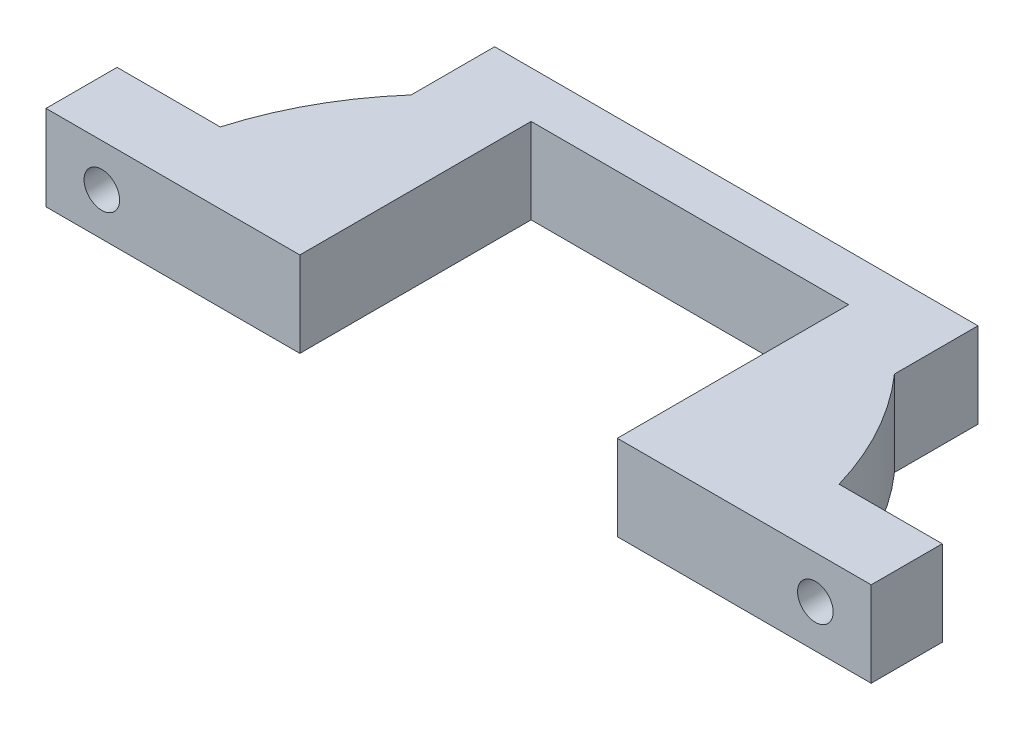
ISO-10303-21;
HEADER;
FILE_DESCRIPTION(('STEP AP214'),'2;1');
FILE_NAME('part.step','',(''),(''),'','','');
FILE_SCHEMA(('AUTOMOTIVE_DESIGN { 1 0 10303 214 1 1 1 1 }'));
ENDSEC;
DATA;
#1=APPLICATION_CONTEXT('core data for automotive mechanical design processes');
#2=APPLICATION_PROTOCOL_DEFINITION('international standard','automotive_design',2000,#1);
#3=PRODUCT_CONTEXT('',#1,'mechanical');
#4=PRODUCT('Part','Part','',(#3));
#5=PRODUCT_RELATED_PRODUCT_CATEGORY('part','',(#4));
#6=PRODUCT_DEFINITION_FORMATION('','',#4);
#7=PRODUCT_DEFINITION_CONTEXT('part definition',#1,'design');
#8=PRODUCT_DEFINITION('design','',#6,#7);
#9=PRODUCT_DEFINITION_SHAPE('','',#8);
#10=(LENGTH_UNIT() NAMED_UNIT(*) SI_UNIT(.MILLI.,.METRE.));
#11=(NAMED_UNIT(*) PLANE_ANGLE_UNIT() SI_UNIT($,.RADIAN.));
#12=(NAMED_UNIT(*) SI_UNIT($,.STERADIAN.) SOLID_ANGLE_UNIT());
#13=UNCERTAINTY_MEASURE_WITH_UNIT(LENGTH_MEASURE(1.E-05),#10,'distance_accuracy_value','');
#14=(GEOMETRIC_REPRESENTATION_CONTEXT(3) GLOBAL_UNCERTAINTY_ASSIGNED_CONTEXT((#13)) GLOBAL_UNIT_ASSIGNED_CONTEXT((#10,
#11,#12)) REPRESENTATION_CONTEXT('',''));
#15=CARTESIAN_POINT('',(0.,0.,0.));
#16=DIRECTION('',(0.,0.,1.));
#17=DIRECTION('',(1.,0.,0.));
#18=AXIS2_PLACEMENT_3D('',#15,#16,#17);
#19=CARTESIAN_POINT('',(37.645,4.5,-1.99999999999952));
#20=DIRECTION('',(0.,0.,-1.));
#21=DIRECTION('',(-1.,0.,0.));
#22=AXIS2_PLACEMENT_3D('',#19,#20,#21);
#23=CYLINDRICAL_SURFACE('',#22,1.875);
#24=CARTESIAN_POINT('',(37.645,4.5,-1.99999999999952));
#25=DIRECTION('',(0.,0.,-1.));
#26=DIRECTION('',(-1.,0.,0.));
#27=AXIS2_PLACEMENT_3D('',#24,#25,#26);
#28=CIRCLE('',#27,1.875);
#29=CARTESIAN_POINT('',(35.77,4.5,-1.99999999999952));
#30=VERTEX_POINT('',#29);
#31=EDGE_CURVE('E490',#30,#30,#28,.T.);
#32=ORIENTED_EDGE('',*,*,#31,.F.);
#33=EDGE_LOOP('',(#32));
#34=FACE_BOUND('',#33,.T.);
#35=CARTESIAN_POINT('',(37.645,4.5,-6.69999999999999));
#36=DIRECTION('',(0.,0.,-1.));
#37=DIRECTION('',(-1.,0.,0.));
#38=AXIS2_PLACEMENT_3D('',#35,#36,#37);
#39=CIRCLE('',#38,1.875);
#40=CARTESIAN_POINT('',(35.77,4.5,-6.69999999999999));
#41=VERTEX_POINT('',#40);
#42=EDGE_CURVE('E500',#41,#41,#39,.T.);
#43=ORIENTED_EDGE('',*,*,#42,.T.);
#44=EDGE_LOOP('',(#43));
#45=FACE_BOUND('',#44,.T.);
#46=ADVANCED_FACE('F34',(#34,#45),#23,.F.);
#47=CARTESIAN_POINT('',(0.,9.,-9.49999999999999));
#48=DIRECTION('',(0.,0.,1.));
#49=DIRECTION('',(1.,0.,0.));
#50=AXIS2_PLACEMENT_3D('',#47,#48,#49);
#51=PLANE('',#50);
#52=CARTESIAN_POINT('',(37.645,4.5,-9.49999999999999));
#53=DIRECTION('',(0.,0.,-1.));
#54=DIRECTION('',(-1.,0.,0.));
#55=AXIS2_PLACEMENT_3D('',#52,#53,#54);
#56=CIRCLE('',#55,3.5);
#57=CARTESIAN_POINT('',(34.145,4.5,-9.49999999999999));
#58=VERTEX_POINT('',#57);
#59=EDGE_CURVE('E497',#58,#58,#56,.T.);
#60=ORIENTED_EDGE('',*,*,#59,.F.);
#61=EDGE_LOOP('',(#60));
#62=FACE_BOUND('',#61,.T.);
#63=DIRECTION('',(-1.,0.,0.));
#64=VECTOR('',#63,1.);
#65=CARTESIAN_POINT('',(0.,0.,-9.49999999999999));
#66=LINE('',#65,#64);
#67=CARTESIAN_POINT('',(43.5342906696074,0.,-9.5));
#68=VERTEX_POINT('',#67);
#69=CARTESIAN_POINT('',(32.6458266858109,0.,-9.5));
#70=VERTEX_POINT('',#69);
#71=EDGE_CURVE('E168',#68,#70,#66,.T.);
#72=ORIENTED_EDGE('',*,*,#71,.T.);
#73=DIRECTION('',(0.,-1.,0.));
#74=VECTOR('',#73,1.);
#75=CARTESIAN_POINT('',(32.6458266858109,9.,-9.5));
#76=LINE('',#75,#74);
#77=CARTESIAN_POINT('',(32.6458266858109,9.,-9.5));
#78=VERTEX_POINT('',#77);
#79=EDGE_CURVE('E11',#78,#70,#76,.T.);
#80=ORIENTED_EDGE('',*,*,#79,.F.);
#81=DIRECTION('',(-1.,0.,0.));
#82=VECTOR('',#81,1.);
#83=CARTESIAN_POINT('',(0.,9.,-9.49999999999999));
#84=LINE('',#83,#82);
#85=CARTESIAN_POINT('',(43.5342906696074,9.,-9.5));
#86=VERTEX_POINT('',#85);
#87=EDGE_CURVE('E203',#86,#78,#84,.T.);
#88=ORIENTED_EDGE('',*,*,#87,.F.);
#89=DIRECTION('',(0.,-1.,0.));
#90=VECTOR('',#89,1.);
#91=CARTESIAN_POINT('',(43.5342906696074,9.,-9.5));
#92=LINE('',#91,#90);
#93=EDGE_CURVE('E167',#86,#68,#92,.T.);
#94=ORIENTED_EDGE('',*,*,#93,.T.);
#95=EDGE_LOOP('',(#72,#80,#88,#94));
#96=FACE_BOUND('',#95,.T.);
#97=ADVANCED_FACE('F36',(#62,#96),#51,.F.);
#98=CARTESIAN_POINT('',(0.,9.,0.));
#99=DIRECTION('',(0.,-1.,0.));
#100=DIRECTION('',(0.,0.,-1.));
#101=AXIS2_PLACEMENT_3D('',#98,#99,#100);
#102=CYLINDRICAL_SURFACE('',#101,34.);
#103=CARTESIAN_POINT('',(0.,0.,0.));
#104=DIRECTION('',(0.,1.,0.));
#105=DIRECTION('',(0.,0.,1.));
#106=AXIS2_PLACEMENT_3D('',#103,#104,#105);
#107=CIRCLE('',#106,34.);
#108=CARTESIAN_POINT('',(25.5,0.,-22.488886144049));
#109=VERTEX_POINT('',#108);
#110=EDGE_CURVE('E171',#70,#109,#107,.T.);
#111=ORIENTED_EDGE('',*,*,#110,.T.);
#112=DIRECTION('',(0.,-1.,0.));
#113=VECTOR('',#112,1.);
#114=CARTESIAN_POINT('',(25.5,9.,-22.488886144049));
#115=LINE('',#114,#113);
#116=CARTESIAN_POINT('',(25.5,9.,-22.488886144049));
#117=VERTEX_POINT('',#116);
#118=EDGE_CURVE('E43',#117,#109,#115,.T.);
#119=ORIENTED_EDGE('',*,*,#118,.F.);
#120=CARTESIAN_POINT('',(0.,9.,0.));
#121=DIRECTION('',(0.,1.,0.));
#122=DIRECTION('',(0.,0.,1.));
#123=AXIS2_PLACEMENT_3D('',#120,#121,#122);
#124=CIRCLE('',#123,34.);
#125=EDGE_CURVE('E111',#78,#117,#124,.T.);
#126=ORIENTED_EDGE('',*,*,#125,.F.);
#127=ORIENTED_EDGE('',*,*,#79,.T.);
#128=EDGE_LOOP('',(#111,#119,#126,#127));
#129=FACE_BOUND('',#128,.T.);
#130=ADVANCED_FACE('F289',(#129),#102,.T.);
#131=CARTESIAN_POINT('',(25.5,9.,0.));
#132=DIRECTION('',(-1.,0.,0.));
#133=DIRECTION('',(0.,0.,1.));
#134=AXIS2_PLACEMENT_3D('',#131,#132,#133);
#135=PLANE('',#134);
#136=DIRECTION('',(0.,0.,-1.));
#137=VECTOR('',#136,1.);
#138=CARTESIAN_POINT('',(25.5,0.,0.));
#139=LINE('',#138,#137);
#140=CARTESIAN_POINT('',(25.5,0.,-31.3048643925988));
#141=VERTEX_POINT('',#140);
#142=EDGE_CURVE('E174',#109,#141,#139,.T.);
#143=ORIENTED_EDGE('',*,*,#142,.T.);
#144=DIRECTION('',(0.,-1.,0.));
#145=VECTOR('',#144,1.);
#146=CARTESIAN_POINT('',(25.5,9.,-31.3048643925988));
#147=LINE('',#146,#145);
#148=CARTESIAN_POINT('',(25.5,9.,-31.3048643925988));
#149=VERTEX_POINT('',#148);
#150=EDGE_CURVE('E221',#149,#141,#147,.T.);
#151=ORIENTED_EDGE('',*,*,#150,.F.);
#152=DIRECTION('',(0.,0.,-1.));
#153=VECTOR('',#152,1.);
#154=CARTESIAN_POINT('',(25.5,9.,0.));
#155=LINE('',#154,#153);
#156=EDGE_CURVE('E229',#117,#149,#155,.T.);
#157=ORIENTED_EDGE('',*,*,#156,.F.);
#158=ORIENTED_EDGE('',*,*,#118,.T.);
#159=EDGE_LOOP('',(#143,#151,#157,#158));
#160=FACE_BOUND('',#159,.T.);
#161=ADVANCED_FACE('F227',(#160),#135,.F.);
#162=CARTESIAN_POINT('',(0.,9.,-31.3048643925988));
#163=DIRECTION('',(0.,0.,1.));
#164=DIRECTION('',(1.,0.,0.));
#165=AXIS2_PLACEMENT_3D('',#162,#163,#164);
#166=PLANE('',#165);
#167=DIRECTION('',(-1.,0.,0.));
#168=VECTOR('',#167,1.);
#169=CARTESIAN_POINT('',(0.,0.,-31.3048643925988));
#170=LINE('',#169,#168);
#171=CARTESIAN_POINT('',(-25.5,0.,-31.3048643925988));
#172=VERTEX_POINT('',#171);
#173=EDGE_CURVE('E176',#141,#172,#170,.T.);
#174=ORIENTED_EDGE('',*,*,#173,.T.);
#175=DIRECTION('',(0.,-1.,0.));
#176=VECTOR('',#175,1.);
#177=CARTESIAN_POINT('',(-25.5,9.,-31.3048643925988));
#178=LINE('',#177,#176);
#179=CARTESIAN_POINT('',(-25.5,9.,-31.3048643925988));
#180=VERTEX_POINT('',#179);
#181=EDGE_CURVE('E219',#180,#172,#178,.T.);
#182=ORIENTED_EDGE('',*,*,#181,.F.);
#183=DIRECTION('',(-1.,0.,0.));
#184=VECTOR('',#183,1.);
#185=CARTESIAN_POINT('',(0.,9.,-31.3048643925988));
#186=LINE('',#185,#184);
#187=EDGE_CURVE('E241',#149,#180,#186,.T.);
#188=ORIENTED_EDGE('',*,*,#187,.F.);
#189=ORIENTED_EDGE('',*,*,#150,.T.);
#190=EDGE_LOOP('',(#174,#182,#188,#189));
#191=FACE_BOUND('',#190,.T.);
#192=ADVANCED_FACE('F238',(#191),#166,.F.);
#193=CARTESIAN_POINT('',(-25.5,9.,0.));
#194=DIRECTION('',(-1.,0.,0.));
#195=DIRECTION('',(0.,0.,1.));
#196=AXIS2_PLACEMENT_3D('',#193,#194,#195);
#197=PLANE('',#196);
#198=DIRECTION('',(0.,0.,-1.));
#199=VECTOR('',#198,1.);
#200=CARTESIAN_POINT('',(-25.5,0.,0.));
#201=LINE('',#200,#199);
#202=CARTESIAN_POINT('',(-25.5,0.,-22.488886144049));
#203=VERTEX_POINT('',#202);
#204=EDGE_CURVE('E179',#203,#172,#201,.T.);
#205=ORIENTED_EDGE('',*,*,#204,.F.);
#206=DIRECTION('',(0.,-1.,0.));
#207=VECTOR('',#206,1.);
#208=CARTESIAN_POINT('',(-25.5,9.,-22.488886144049));
#209=LINE('',#208,#207);
#210=CARTESIAN_POINT('',(-25.5,9.,-22.488886144049));
#211=VERTEX_POINT('',#210);
#212=EDGE_CURVE('E217',#211,#203,#209,.T.);
#213=ORIENTED_EDGE('',*,*,#212,.F.);
#214=DIRECTION('',(0.,0.,-1.));
#215=VECTOR('',#214,1.);
#216=CARTESIAN_POINT('',(-25.5,9.,0.));
#217=LINE('',#216,#215);
#218=EDGE_CURVE('E243',#211,#180,#217,.T.);
#219=ORIENTED_EDGE('',*,*,#218,.T.);
#220=ORIENTED_EDGE('',*,*,#181,.T.);
#221=EDGE_LOOP('',(#205,#213,#219,#220));
#222=FACE_BOUND('',#221,.T.);
#223=ADVANCED_FACE('F427',(#222),#197,.T.);
#224=CARTESIAN_POINT('',(0.,9.,0.));
#225=DIRECTION('',(0.,-1.,0.));
#226=DIRECTION('',(0.,0.,-1.));
#227=AXIS2_PLACEMENT_3D('',#224,#225,#226);
#228=CYLINDRICAL_SURFACE('',#227,34.);
#229=CARTESIAN_POINT('',(0.,0.,0.));
#230=DIRECTION('',(0.,1.,0.));
#231=DIRECTION('',(0.,0.,1.));
#232=AXIS2_PLACEMENT_3D('',#229,#230,#231);
#233=CIRCLE('',#232,34.);
#234=CARTESIAN_POINT('',(-32.6458266858109,0.,-9.5));
#235=VERTEX_POINT('',#234);
#236=EDGE_CURVE('E182',#203,#235,#233,.T.);
#237=ORIENTED_EDGE('',*,*,#236,.T.);
#238=DIRECTION('',(0.,-1.,0.));
#239=VECTOR('',#238,1.);
#240=CARTESIAN_POINT('',(-32.6458266858109,9.,-9.5));
#241=LINE('',#240,#239);
#242=CARTESIAN_POINT('',(-32.6458266858109,9.,-9.5));
#243=VERTEX_POINT('',#242);
#244=EDGE_CURVE('E215',#243,#235,#241,.T.);
#245=ORIENTED_EDGE('',*,*,#244,.F.);
#246=CARTESIAN_POINT('',(0.,9.,0.));
#247=DIRECTION('',(0.,1.,0.));
#248=DIRECTION('',(0.,0.,1.));
#249=AXIS2_PLACEMENT_3D('',#246,#247,#248);
#250=CIRCLE('',#249,34.);
#251=EDGE_CURVE('E245',#211,#243,#250,.T.);
#252=ORIENTED_EDGE('',*,*,#251,.F.);
#253=ORIENTED_EDGE('',*,*,#212,.T.);
#254=EDGE_LOOP('',(#237,#245,#252,#253));
#255=FACE_BOUND('',#254,.T.);
#256=ADVANCED_FACE('F422',(#255),#228,.T.);
#257=CARTESIAN_POINT('',(0.,9.,-9.49999999999999));
#258=DIRECTION('',(0.,0.,-1.));
#259=DIRECTION('',(-1.,0.,0.));
#260=AXIS2_PLACEMENT_3D('',#257,#258,#259);
#261=PLANE('',#260);
#262=CARTESIAN_POINT('',(-37.645,4.5,-9.49999999999998));
#263=DIRECTION('',(0.,0.,-1.));
#264=DIRECTION('',(1.,0.,0.));
#265=AXIS2_PLACEMENT_3D('',#262,#263,#264);
#266=CIRCLE('',#265,3.5);
#267=CARTESIAN_POINT('',(-34.145,4.5,-9.49999999999998));
#268=VERTEX_POINT('',#267);
#269=EDGE_CURVE('E506',#268,#268,#266,.T.);
#270=ORIENTED_EDGE('',*,*,#269,.F.);
#271=EDGE_LOOP('',(#270));
#272=FACE_BOUND('',#271,.T.);
#273=DIRECTION('',(1.,0.,0.));
#274=VECTOR('',#273,1.);
#275=CARTESIAN_POINT('',(0.,0.,-9.49999999999999));
#276=LINE('',#275,#274);
#277=CARTESIAN_POINT('',(-43.5342906696074,0.,-9.5));
#278=VERTEX_POINT('',#277);
#279=EDGE_CURVE('E185',#278,#235,#276,.T.);
#280=ORIENTED_EDGE('',*,*,#279,.F.);
#281=DIRECTION('',(0.,-1.,0.));
#282=VECTOR('',#281,1.);
#283=CARTESIAN_POINT('',(-43.5342906696074,9.,-9.5));
#284=LINE('',#283,#282);
#285=CARTESIAN_POINT('',(-43.5342906696074,9.,-9.5));
#286=VERTEX_POINT('',#285);
#287=EDGE_CURVE('E213',#286,#278,#284,.T.);
#288=ORIENTED_EDGE('',*,*,#287,.F.);
#289=DIRECTION('',(1.,0.,0.));
#290=VECTOR('',#289,1.);
#291=CARTESIAN_POINT('',(0.,9.,-9.49999999999999));
#292=LINE('',#291,#290);
#293=EDGE_CURVE('E251',#286,#243,#292,.T.);
#294=ORIENTED_EDGE('',*,*,#293,.T.);
#295=ORIENTED_EDGE('',*,*,#244,.T.);
#296=EDGE_LOOP('',(#280,#288,#294,#295));
#297=FACE_BOUND('',#296,.T.);
#298=ADVANCED_FACE('F413',(#272,#297),#261,.T.);
#299=CARTESIAN_POINT('',(-43.5342906696074,9.,0.));
#300=DIRECTION('',(-1.,0.,0.));
#301=DIRECTION('',(0.,0.,1.));
#302=AXIS2_PLACEMENT_3D('',#299,#300,#301);
#303=PLANE('',#302);
#304=DIRECTION('',(0.,0.,-1.));
#305=VECTOR('',#304,1.);
#306=CARTESIAN_POINT('',(-43.5342906696074,0.,0.));
#307=LINE('',#306,#305);
#308=CARTESIAN_POINT('',(-43.5342906696074,0.,-2.));
#309=VERTEX_POINT('',#308);
#310=EDGE_CURVE('E188',#309,#278,#307,.T.);
#311=ORIENTED_EDGE('',*,*,#310,.F.);
#312=DIRECTION('',(0.,-1.,0.));
#313=VECTOR('',#312,1.);
#314=CARTESIAN_POINT('',(-43.5342906696074,9.,-2.));
#315=LINE('',#314,#313);
#316=CARTESIAN_POINT('',(-43.5342906696074,9.,-2.));
#317=VERTEX_POINT('',#316);
#318=EDGE_CURVE('E211',#317,#309,#315,.T.);
#319=ORIENTED_EDGE('',*,*,#318,.F.);
#320=DIRECTION('',(0.,0.,-1.));
#321=VECTOR('',#320,1.);
#322=CARTESIAN_POINT('',(-43.5342906696074,9.,0.));
#323=LINE('',#322,#321);
#324=EDGE_CURVE('E254',#317,#286,#323,.T.);
#325=ORIENTED_EDGE('',*,*,#324,.T.);
#326=ORIENTED_EDGE('',*,*,#287,.T.);
#327=EDGE_LOOP('',(#311,#319,#325,#326));
#328=FACE_BOUND('',#327,.T.);
#329=ADVANCED_FACE('F408',(#328),#303,.T.);
#330=CARTESIAN_POINT('',(0.,9.,-1.99999999999885));
#331=DIRECTION('',(0.,0.,1.));
#332=DIRECTION('',(1.,0.,0.));
#333=AXIS2_PLACEMENT_3D('',#330,#331,#332);
#334=PLANE('',#333);
#335=CARTESIAN_POINT('',(-37.645,4.5,-1.99999999999951));
#336=DIRECTION('',(0.,0.,-1.));
#337=DIRECTION('',(-1.,0.,0.));
#338=AXIS2_PLACEMENT_3D('',#335,#336,#337);
#339=CIRCLE('',#338,1.875);
#340=CARTESIAN_POINT('',(-39.52,4.5,-1.99999999999951));
#341=VERTEX_POINT('',#340);
#342=EDGE_CURVE('E172',#341,#341,#339,.F.);
#343=ORIENTED_EDGE('',*,*,#342,.F.);
#344=EDGE_LOOP('',(#343));
#345=FACE_BOUND('',#344,.T.);
#346=DIRECTION('',(-1.,0.,0.));
#347=VECTOR('',#346,1.);
#348=CARTESIAN_POINT('',(0.,0.,-1.99999999999885));
#349=LINE('',#348,#347);
#350=CARTESIAN_POINT('',(-16.75,0.,-1.99999999999958));
#351=VERTEX_POINT('',#350);
#352=EDGE_CURVE('E191',#351,#309,#349,.T.);
#353=ORIENTED_EDGE('',*,*,#352,.F.);
#354=DIRECTION('',(0.,-1.,0.));
#355=VECTOR('',#354,1.);
#356=CARTESIAN_POINT('',(-16.75,9.,-1.99999999999958));
#357=LINE('',#356,#355);
#358=CARTESIAN_POINT('',(-16.75,9.,-1.99999999999958));
#359=VERTEX_POINT('',#358);
#360=EDGE_CURVE('E209',#359,#351,#357,.T.);
#361=ORIENTED_EDGE('',*,*,#360,.F.);
#362=DIRECTION('',(-1.,0.,0.));
#363=VECTOR('',#362,1.);
#364=CARTESIAN_POINT('',(0.,9.,-1.99999999999885));
#365=LINE('',#364,#363);
#366=EDGE_CURVE('E257',#359,#317,#365,.T.);
#367=ORIENTED_EDGE('',*,*,#366,.T.);
#368=ORIENTED_EDGE('',*,*,#318,.T.);
#369=EDGE_LOOP('',(#353,#361,#367,#368));
#370=FACE_BOUND('',#369,.T.);
#371=ADVANCED_FACE('F401',(#345,#370),#334,.T.);
#372=CARTESIAN_POINT('',(-16.75,9.,0.));
#373=DIRECTION('',(-1.,0.,0.));
#374=DIRECTION('',(0.,0.,1.));
#375=AXIS2_PLACEMENT_3D('',#372,#373,#374);
#376=PLANE('',#375);
#377=DIRECTION('',(0.,0.,-1.));
#378=VECTOR('',#377,1.);
#379=CARTESIAN_POINT('',(-16.75,0.,0.));
#380=LINE('',#379,#378);
#381=CARTESIAN_POINT('',(-16.75,0.,-26.4024321962993));
#382=VERTEX_POINT('',#381);
#383=EDGE_CURVE('E194',#351,#382,#380,.T.);
#384=ORIENTED_EDGE('',*,*,#383,.T.);
#385=DIRECTION('',(0.,-1.,0.));
#386=VECTOR('',#385,1.);
#387=CARTESIAN_POINT('',(-16.75,9.,-26.4024321962993));
#388=LINE('',#387,#386);
#389=CARTESIAN_POINT('',(-16.75,9.,-26.4024321962993));
#390=VERTEX_POINT('',#389);
#391=EDGE_CURVE('E207',#390,#382,#388,.T.);
#392=ORIENTED_EDGE('',*,*,#391,.F.);
#393=DIRECTION('',(0.,0.,-1.));
#394=VECTOR('',#393,1.);
#395=CARTESIAN_POINT('',(-16.75,9.,0.));
#396=LINE('',#395,#394);
#397=EDGE_CURVE('E162',#359,#390,#396,.T.);
#398=ORIENTED_EDGE('',*,*,#397,.F.);
#399=ORIENTED_EDGE('',*,*,#360,.T.);
#400=EDGE_LOOP('',(#384,#392,#398,#399));
#401=FACE_BOUND('',#400,.T.);
#402=ADVANCED_FACE('F264',(#401),#376,.F.);
#403=CARTESIAN_POINT('',(0.,9.,-26.4024321962993));
#404=DIRECTION('',(0.,0.,1.));
#405=DIRECTION('',(1.,0.,0.));
#406=AXIS2_PLACEMENT_3D('',#403,#404,#405);
#407=PLANE('',#406);
#408=DIRECTION('',(-1.,0.,0.));
#409=VECTOR('',#408,1.);
#410=CARTESIAN_POINT('',(0.,0.,-26.4024321962993));
#411=LINE('',#410,#409);
#412=CARTESIAN_POINT('',(16.75,0.,-26.4024321962993));
#413=VERTEX_POINT('',#412);
#414=EDGE_CURVE('E197',#413,#382,#411,.T.);
#415=ORIENTED_EDGE('',*,*,#414,.F.);
#416=DIRECTION('',(0.,-1.,0.));
#417=VECTOR('',#416,1.);
#418=CARTESIAN_POINT('',(16.75,9.,-26.4024321962993));
#419=LINE('',#418,#417);
#420=CARTESIAN_POINT('',(16.75,9.,-26.4024321962993));
#421=VERTEX_POINT('',#420);
#422=EDGE_CURVE('E151',#421,#413,#419,.T.);
#423=ORIENTED_EDGE('',*,*,#422,.F.);
#424=DIRECTION('',(-1.,0.,0.));
#425=VECTOR('',#424,1.);
#426=CARTESIAN_POINT('',(0.,9.,-26.4024321962993));
#427=LINE('',#426,#425);
#428=EDGE_CURVE('E160',#421,#390,#427,.T.);
#429=ORIENTED_EDGE('',*,*,#428,.T.);
#430=ORIENTED_EDGE('',*,*,#391,.T.);
#431=EDGE_LOOP('',(#415,#423,#429,#430));
#432=FACE_BOUND('',#431,.T.);
#433=ADVANCED_FACE('F268',(#432),#407,.T.);
#434=CARTESIAN_POINT('',(16.75,9.,0.));
#435=DIRECTION('',(-1.,0.,0.));
#436=DIRECTION('',(0.,0.,1.));
#437=AXIS2_PLACEMENT_3D('',#434,#435,#436);
#438=PLANE('',#437);
#439=DIRECTION('',(0.,0.,-1.));
#440=VECTOR('',#439,1.);
#441=CARTESIAN_POINT('',(16.75,0.,0.));
#442=LINE('',#441,#440);
#443=CARTESIAN_POINT('',(16.75,0.,-1.99999999999982));
#444=VERTEX_POINT('',#443);
#445=EDGE_CURVE('E150',#444,#413,#442,.T.);
#446=ORIENTED_EDGE('',*,*,#445,.F.);
#447=DIRECTION('',(0.,-1.,0.));
#448=VECTOR('',#447,1.);
#449=CARTESIAN_POINT('',(16.75,9.,-1.99999999999982));
#450=LINE('',#449,#448);
#451=CARTESIAN_POINT('',(16.75,9.,-1.99999999999982));
#452=VERTEX_POINT('',#451);
#453=EDGE_CURVE('E144',#452,#444,#450,.T.);
#454=ORIENTED_EDGE('',*,*,#453,.F.);
#455=DIRECTION('',(0.,0.,-1.));
#456=VECTOR('',#455,1.);
#457=CARTESIAN_POINT('',(16.75,9.,0.));
#458=LINE('',#457,#456);
#459=EDGE_CURVE('E148',#452,#421,#458,.T.);
#460=ORIENTED_EDGE('',*,*,#459,.T.);
#461=ORIENTED_EDGE('',*,*,#422,.T.);
#462=EDGE_LOOP('',(#446,#454,#460,#461));
#463=FACE_BOUND('',#462,.T.);
#464=ADVANCED_FACE('F146',(#463),#438,.T.);
#465=CARTESIAN_POINT('',(0.,9.,-1.9999999999997));
#466=DIRECTION('',(0.,0.,-1.));
#467=DIRECTION('',(-1.,0.,0.));
#468=AXIS2_PLACEMENT_3D('',#465,#466,#467);
#469=PLANE('',#468);
#470=ORIENTED_EDGE('',*,*,#31,.T.);
#471=EDGE_LOOP('',(#470));
#472=FACE_BOUND('',#471,.T.);
#473=DIRECTION('',(1.,0.,0.));
#474=VECTOR('',#473,1.);
#475=CARTESIAN_POINT('',(0.,0.,-1.9999999999997));
#476=LINE('',#475,#474);
#477=CARTESIAN_POINT('',(43.5342906696074,0.,-2.));
#478=VERTEX_POINT('',#477);
#479=EDGE_CURVE('E97',#444,#478,#476,.T.);
#480=ORIENTED_EDGE('',*,*,#479,.T.);
#481=DIRECTION('',(0.,-1.,0.));
#482=VECTOR('',#481,1.);
#483=CARTESIAN_POINT('',(43.5342906696074,9.,-2.));
#484=LINE('',#483,#482);
#485=CARTESIAN_POINT('',(43.5342906696074,9.,-2.));
#486=VERTEX_POINT('',#485);
#487=EDGE_CURVE('E152',#486,#478,#484,.T.);
#488=ORIENTED_EDGE('',*,*,#487,.F.);
#489=DIRECTION('',(1.,0.,0.));
#490=VECTOR('',#489,1.);
#491=CARTESIAN_POINT('',(0.,9.,-1.9999999999997));
#492=LINE('',#491,#490);
#493=EDGE_CURVE('E154',#452,#486,#492,.T.);
#494=ORIENTED_EDGE('',*,*,#493,.F.);
#495=ORIENTED_EDGE('',*,*,#453,.T.);
#496=EDGE_LOOP('',(#480,#488,#494,#495));
#497=FACE_BOUND('',#496,.T.);
#498=ADVANCED_FACE('F155',(#472,#497),#469,.F.);
#499=CARTESIAN_POINT('',(43.5342906696074,9.,0.));
#500=DIRECTION('',(-1.,0.,0.));
#501=DIRECTION('',(0.,0.,1.));
#502=AXIS2_PLACEMENT_3D('',#499,#500,#501);
#503=PLANE('',#502);
#504=DIRECTION('',(0.,0.,-1.));
#505=VECTOR('',#504,1.);
#506=CARTESIAN_POINT('',(43.5342906696074,0.,0.));
#507=LINE('',#506,#505);
#508=EDGE_CURVE('E103',#478,#68,#507,.T.);
#509=ORIENTED_EDGE('',*,*,#508,.T.);
#510=ORIENTED_EDGE('',*,*,#93,.F.);
#511=DIRECTION('',(0.,0.,-1.));
#512=VECTOR('',#511,1.);
#513=CARTESIAN_POINT('',(43.5342906696074,9.,0.));
#514=LINE('',#513,#512);
#515=EDGE_CURVE('E51',#486,#86,#514,.T.);
#516=ORIENTED_EDGE('',*,*,#515,.F.);
#517=ORIENTED_EDGE('',*,*,#487,.T.);
#518=EDGE_LOOP('',(#509,#510,#516,#517));
#519=FACE_BOUND('',#518,.T.);
#520=ADVANCED_FACE('F272',(#519),#503,.F.);
#521=CARTESIAN_POINT('',(0.,9.,0.));
#522=DIRECTION('',(0.,1.,0.));
#523=DIRECTION('',(0.,0.,1.));
#524=AXIS2_PLACEMENT_3D('',#521,#522,#523);
#525=PLANE('',#524);
#526=ORIENTED_EDGE('',*,*,#87,.T.);
#527=ORIENTED_EDGE('',*,*,#125,.T.);
#528=ORIENTED_EDGE('',*,*,#156,.T.);
#529=ORIENTED_EDGE('',*,*,#187,.T.);
#530=ORIENTED_EDGE('',*,*,#218,.F.);
#531=ORIENTED_EDGE('',*,*,#251,.T.);
#532=ORIENTED_EDGE('',*,*,#293,.F.);
#533=ORIENTED_EDGE('',*,*,#324,.F.);
#534=ORIENTED_EDGE('',*,*,#366,.F.);
#535=ORIENTED_EDGE('',*,*,#397,.T.);
#536=ORIENTED_EDGE('',*,*,#428,.F.);
#537=ORIENTED_EDGE('',*,*,#459,.F.);
#538=ORIENTED_EDGE('',*,*,#493,.T.);
#539=ORIENTED_EDGE('',*,*,#515,.T.);
#540=EDGE_LOOP('',(#526,#527,#528,#529,#530,#531,#532,#533,#534,#535,#536,#537,#538,#539));
#541=FACE_BOUND('',#540,.T.);
#542=ADVANCED_FACE('F158',(#541),#525,.T.);
#543=CARTESIAN_POINT('',(0.,0.,0.));
#544=DIRECTION('',(0.,1.,0.));
#545=DIRECTION('',(0.,0.,1.));
#546=AXIS2_PLACEMENT_3D('',#543,#544,#545);
#547=PLANE('',#546);
#548=ORIENTED_EDGE('',*,*,#71,.F.);
#549=ORIENTED_EDGE('',*,*,#508,.F.);
#550=ORIENTED_EDGE('',*,*,#479,.F.);
#551=ORIENTED_EDGE('',*,*,#445,.T.);
#552=ORIENTED_EDGE('',*,*,#414,.T.);
#553=ORIENTED_EDGE('',*,*,#383,.F.);
#554=ORIENTED_EDGE('',*,*,#352,.T.);
#555=ORIENTED_EDGE('',*,*,#310,.T.);
#556=ORIENTED_EDGE('',*,*,#279,.T.);
#557=ORIENTED_EDGE('',*,*,#236,.F.);
#558=ORIENTED_EDGE('',*,*,#204,.T.);
#559=ORIENTED_EDGE('',*,*,#173,.F.);
#560=ORIENTED_EDGE('',*,*,#142,.F.);
#561=ORIENTED_EDGE('',*,*,#110,.F.);
#562=EDGE_LOOP('',(#548,#549,#550,#551,#552,#553,#554,#555,#556,#557,#558,#559,#560,#561));
#563=FACE_BOUND('',#562,.T.);
#564=ADVANCED_FACE('F233',(#563),#547,.F.);
#565=CARTESIAN_POINT('',(-37.645,4.5,-1.99999999999951));
#566=DIRECTION('',(0.,0.,-1.));
#567=DIRECTION('',(-1.,0.,0.));
#568=AXIS2_PLACEMENT_3D('',#565,#566,#567);
#569=CYLINDRICAL_SURFACE('',#568,1.875);
#570=CARTESIAN_POINT('',(-37.645,4.5,-6.69999999999998));
#571=DIRECTION('',(0.,0.,-1.));
#572=DIRECTION('',(1.,0.,0.));
#573=AXIS2_PLACEMENT_3D('',#570,#571,#572);
#574=CIRCLE('',#573,1.875);
#575=CARTESIAN_POINT('',(-35.77,4.5,-6.69999999999998));
#576=VERTEX_POINT('',#575);
#577=EDGE_CURVE('E509',#576,#576,#574,.T.);
#578=ORIENTED_EDGE('',*,*,#577,.T.);
#579=EDGE_LOOP('',(#578));
#580=FACE_BOUND('',#579,.T.);
#581=ORIENTED_EDGE('',*,*,#342,.T.);
#582=EDGE_LOOP('',(#581));
#583=FACE_BOUND('',#582,.T.);
#584=ADVANCED_FACE('F297',(#580,#583),#569,.F.);
#585=CARTESIAN_POINT('',(37.645,4.5,-6.69999999999999));
#586=DIRECTION('',(0.,0.,-1.));
#587=DIRECTION('',(-1.,0.,0.));
#588=AXIS2_PLACEMENT_3D('',#585,#586,#587);
#589=CYLINDRICAL_SURFACE('',#588,3.5);
#590=CARTESIAN_POINT('',(37.645,4.5,-6.69999999999999));
#591=DIRECTION('',(0.,0.,-1.));
#592=DIRECTION('',(-1.,0.,0.));
#593=AXIS2_PLACEMENT_3D('',#590,#591,#592);
#594=CIRCLE('',#593,3.5);
#595=CARTESIAN_POINT('',(34.145,4.5,-6.69999999999999));
#596=VERTEX_POINT('',#595);
#597=EDGE_CURVE('E493',#596,#596,#594,.T.);
#598=ORIENTED_EDGE('',*,*,#597,.F.);
#599=EDGE_LOOP('',(#598));
#600=FACE_BOUND('',#599,.T.);
#601=ORIENTED_EDGE('',*,*,#59,.T.);
#602=EDGE_LOOP('',(#601));
#603=FACE_BOUND('',#602,.T.);
#604=ADVANCED_FACE('F295',(#600,#603),#589,.F.);
#605=CARTESIAN_POINT('',(37.645,4.5,-6.69999999999999));
#606=DIRECTION('',(0.,0.,-1.));
#607=DIRECTION('',(-1.,0.,0.));
#608=AXIS2_PLACEMENT_3D('',#605,#606,#607);
#609=PLANE('',#608);
#610=ORIENTED_EDGE('',*,*,#42,.F.);
#611=EDGE_LOOP('',(#610));
#612=FACE_BOUND('',#611,.T.);
#613=ORIENTED_EDGE('',*,*,#597,.T.);
#614=EDGE_LOOP('',(#613));
#615=FACE_BOUND('',#614,.T.);
#616=ADVANCED_FACE('F317',(#612,#615),#609,.T.);
#617=CARTESIAN_POINT('',(-37.645,4.5,-6.69999999999998));
#618=DIRECTION('',(0.,0.,-1.));
#619=DIRECTION('',(-1.,0.,0.));
#620=AXIS2_PLACEMENT_3D('',#617,#618,#619);
#621=CYLINDRICAL_SURFACE('',#620,3.5);
#622=CARTESIAN_POINT('',(-37.645,4.5,-6.69999999999998));
#623=DIRECTION('',(0.,0.,-1.));
#624=DIRECTION('',(1.,0.,0.));
#625=AXIS2_PLACEMENT_3D('',#622,#623,#624);
#626=CIRCLE('',#625,3.5);
#627=CARTESIAN_POINT('',(-34.145,4.5,-6.69999999999998));
#628=VERTEX_POINT('',#627);
#629=EDGE_CURVE('E505',#628,#628,#626,.T.);
#630=ORIENTED_EDGE('',*,*,#629,.F.);
#631=EDGE_LOOP('',(#630));
#632=FACE_BOUND('',#631,.T.);
#633=ORIENTED_EDGE('',*,*,#269,.T.);
#634=EDGE_LOOP('',(#633));
#635=FACE_BOUND('',#634,.T.);
#636=ADVANCED_FACE('F324',(#632,#635),#621,.F.);
#637=CARTESIAN_POINT('',(-37.645,4.5,-6.69999999999998));
#638=DIRECTION('',(0.,0.,1.));
#639=DIRECTION('',(1.,0.,0.));
#640=AXIS2_PLACEMENT_3D('',#637,#638,#639);
#641=PLANE('',#640);
#642=ORIENTED_EDGE('',*,*,#577,.F.);
#643=EDGE_LOOP('',(#642));
#644=FACE_BOUND('',#643,.T.);
#645=ORIENTED_EDGE('',*,*,#629,.T.);
#646=EDGE_LOOP('',(#645));
#647=FACE_BOUND('',#646,.T.);
#648=ADVANCED_FACE('F331',(#644,#647),#641,.F.);
#649=CLOSED_SHELL('',(#46,#97,#130,#161,#192,#223,#256,#298,#329,#371,#402,#433,#464,#498,#520,
#542,#564,#584,#604,#616,#636,#648));
#650=MANIFOLD_SOLID_BREP('B2',#649);
#651=ADVANCED_BREP_SHAPE_REPRESENTATION('',(#18,#650),#14);
#652=SHAPE_DEFINITION_REPRESENTATION(#9,#651);
ENDSEC;
END-ISO-10303-21;
